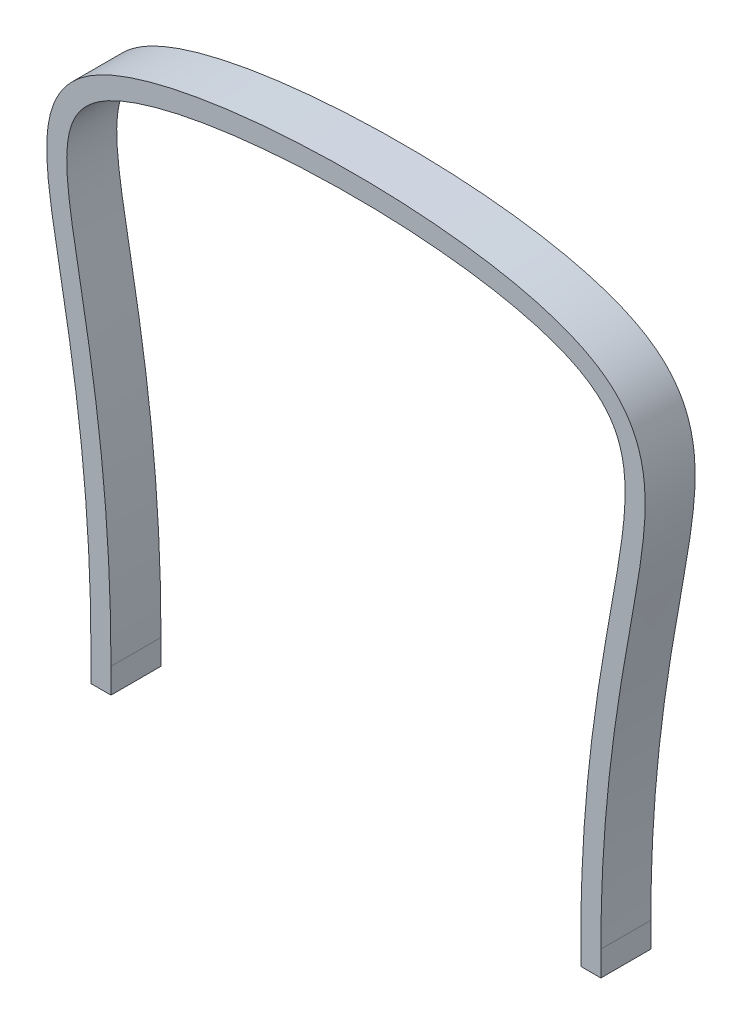
ISO-10303-21;
HEADER;
FILE_DESCRIPTION(('STEP AP214'),'2;1');
FILE_NAME('part.step','',(''),(''),'','','');
FILE_SCHEMA(('AUTOMOTIVE_DESIGN { 1 0 10303 214 1 1 1 1 }'));
ENDSEC;
DATA;
#1=APPLICATION_CONTEXT('core data for automotive mechanical design processes');
#2=APPLICATION_PROTOCOL_DEFINITION('international standard','automotive_design',2000,#1);
#3=PRODUCT_CONTEXT('',#1,'mechanical');
#4=PRODUCT('Part','Part','',(#3));
#5=PRODUCT_RELATED_PRODUCT_CATEGORY('part','',(#4));
#6=PRODUCT_DEFINITION_FORMATION('','',#4);
#7=PRODUCT_DEFINITION_CONTEXT('part definition',#1,'design');
#8=PRODUCT_DEFINITION('design','',#6,#7);
#9=PRODUCT_DEFINITION_SHAPE('','',#8);
#10=(LENGTH_UNIT() NAMED_UNIT(*) SI_UNIT(.MILLI.,.METRE.));
#11=(NAMED_UNIT(*) PLANE_ANGLE_UNIT() SI_UNIT($,.RADIAN.));
#12=(NAMED_UNIT(*) SI_UNIT($,.STERADIAN.) SOLID_ANGLE_UNIT());
#13=UNCERTAINTY_MEASURE_WITH_UNIT(LENGTH_MEASURE(1.E-05),#10,'distance_accuracy_value','');
#14=(GEOMETRIC_REPRESENTATION_CONTEXT(3) GLOBAL_UNCERTAINTY_ASSIGNED_CONTEXT((#13)) GLOBAL_UNIT_ASSIGNED_CONTEXT((#10,
#11,#12)) REPRESENTATION_CONTEXT('',''));
#15=CARTESIAN_POINT('',(0.,0.,0.));
#16=DIRECTION('',(0.,0.,1.));
#17=DIRECTION('',(1.,0.,0.));
#18=AXIS2_PLACEMENT_3D('',#15,#16,#17);
#19=CARTESIAN_POINT('',(-51.,0.,5.));
#20=DIRECTION('',(0.,0.,1.));
#21=DIRECTION('',(1.,0.,0.));
#22=AXIS2_PLACEMENT_3D('',#19,#20,#21);
#23=PLANE('',#22);
#24=CARTESIAN_POINT('',(-51.,0.,5.));
#25=CARTESIAN_POINT('',(-50.9939158983148,14.0079411844844,5.));
#26=CARTESIAN_POINT('',(-52.6916647073924,37.8272965966043,5.));
#27=CARTESIAN_POINT('',(-56.4295822448929,59.1981943965522,5.));
#28=CARTESIAN_POINT('',(-58.8718908608169,72.4728642051469,5.));
#29=CARTESIAN_POINT('',(-59.9906411581549,80.9564008757759,5.));
#30=CARTESIAN_POINT('',(-59.8482362618242,87.2736222326708,5.));
#31=CARTESIAN_POINT('',(-58.4666978349904,92.1639115550484,5.));
#32=CARTESIAN_POINT('',(-56.4370599692739,95.7228120031364,5.));
#33=CARTESIAN_POINT('',(-53.5144229960345,98.724680975445,5.));
#34=CARTESIAN_POINT('',(-50.7947948900949,100.525327543125,5.));
#35=CARTESIAN_POINT('',(-48.0497094835202,101.975149445809,5.));
#36=CARTESIAN_POINT('',(-45.0542295014906,103.295407098608,5.));
#37=CARTESIAN_POINT('',(-36.9311951979304,106.001290542632,5.));
#38=CARTESIAN_POINT('',(-22.1031727229768,108.736204229261,5.));
#39=CARTESIAN_POINT('',(-0.0315882016813909,110.056337559532,5.));
#40=CARTESIAN_POINT('',(22.0599381139701,109.047906079575,5.));
#41=CARTESIAN_POINT('',(36.9506499659262,106.334441293828,5.));
#42=CARTESIAN_POINT('',(45.1541967761085,103.414588011981,5.));
#43=CARTESIAN_POINT('',(48.1928062961276,101.9455729061,5.));
#44=CARTESIAN_POINT('',(50.9721994924086,100.312683081899,5.));
#45=CARTESIAN_POINT('',(53.7125423698637,98.2647928715529,5.));
#46=CARTESIAN_POINT('',(56.5797280575046,94.9085285501916,5.));
#47=CARTESIAN_POINT('',(58.5191733912946,91.0508570608467,5.));
#48=CARTESIAN_POINT('',(60.010062785228,85.148050903776,5.));
#49=CARTESIAN_POINT('',(59.9033006716471,76.8200327339042,5.));
#50=CARTESIAN_POINT('',(57.9715243729975,64.6609238006301,5.));
#51=CARTESIAN_POINT('',(55.0408595619276,48.8716214985142,5.));
#52=CARTESIAN_POINT('',(52.0427169733924,28.1799052357803,5.));
#53=CARTESIAN_POINT('',(50.9957016467325,10.0765282928764,5.));
#54=CARTESIAN_POINT('',(51.,0.,5.));
#55=B_SPLINE_CURVE_WITH_KNOTS('',3,(#24,#25,#26,#27,#28,#29,#30,#31,#32,#33,#34,#35,#36,#37,#38,
#39,#40,#41,#42,#43,#44,#45,#46,#47,#48,#49,#50,#51,#52,#53,#54),.UNSPECIFIED.,.F.,.F.,(4,1,1,1,
1,1,1,1,1,1,1,1,1,1,1,1,1,1,1,1,1,1,1,1,1,1,1,1,4),(0.,0.07,0.14,0.176666666666666,
0.213333333333333,0.249999999999999,0.270833333333333,0.291666666666698,0.3125,
0.333333333333333,0.337931034482759,0.354166666666667,0.375,0.4375,0.5,0.5625,0.625,
0.645833333333333,0.662068965517241,0.666666666666667,0.6875,0.708333333333333,
0.729166666666706,0.750000000000008,0.796666666666667,0.843333333333333,0.89,0.945,1.),.UNSPECIFIED.);
#56=CARTESIAN_POINT('',(-51.,0.,5.));
#57=VERTEX_POINT('',#56);
#58=CARTESIAN_POINT('',(51.,0.,5.));
#59=VERTEX_POINT('',#58);
#60=EDGE_CURVE('E73',#57,#59,#55,.T.);
#61=ORIENTED_EDGE('',*,*,#60,.F.);
#62=DIRECTION('',(0.,1.,0.));
#63=VECTOR('',#62,1.);
#64=CARTESIAN_POINT('',(-51.,-5.,5.));
#65=LINE('',#64,#63);
#66=CARTESIAN_POINT('',(-51.,-5.,5.));
#67=VERTEX_POINT('',#66);
#68=EDGE_CURVE('E155',#67,#57,#65,.T.);
#69=ORIENTED_EDGE('',*,*,#68,.F.);
#70=DIRECTION('',(-1.,0.,0.));
#71=VECTOR('',#70,1.);
#72=CARTESIAN_POINT('',(-47.,-5.,5.));
#73=LINE('',#72,#71);
#74=CARTESIAN_POINT('',(-47.,-5.,5.));
#75=VERTEX_POINT('',#74);
#76=EDGE_CURVE('E148',#75,#67,#73,.T.);
#77=ORIENTED_EDGE('',*,*,#76,.F.);
#78=DIRECTION('',(0.,1.,0.));
#79=VECTOR('',#78,1.);
#80=CARTESIAN_POINT('',(-47.,-5.,5.));
#81=LINE('',#80,#79);
#82=CARTESIAN_POINT('',(-47.,0.,5.));
#83=VERTEX_POINT('',#82);
#84=EDGE_CURVE('E157',#75,#83,#81,.T.);
#85=ORIENTED_EDGE('',*,*,#84,.T.);
#86=CARTESIAN_POINT('',(-47.,0.,5.));
#87=CARTESIAN_POINT('',(-47.,14.1678904448825,5.));
#88=CARTESIAN_POINT('',(-48.7099170124481,38.3071443777987,5.));
#89=CARTESIAN_POINT('',(-52.5013962655601,59.9500836802956,5.));
#90=CARTESIAN_POINT('',(-54.9296501350194,73.1541154957616,5.));
#91=CARTESIAN_POINT('',(-55.9932265880073,81.2923477800299,5.));
#92=CARTESIAN_POINT('',(-55.8266879192895,86.8105046067798,5.));
#93=CARTESIAN_POINT('',(-54.7298430502037,90.625037430008,5.));
#94=CARTESIAN_POINT('',(-53.2166005076598,93.2755599127199,5.));
#95=CARTESIAN_POINT('',(-50.9812207732317,95.5886454763646,5.));
#96=CARTESIAN_POINT('',(-48.7297717842323,97.0922000296025,5.));
#97=CARTESIAN_POINT('',(-46.3398455509451,98.3542379754933,5.));
#98=CARTESIAN_POINT('',(-43.6470003457814,99.544917332511,5.));
#99=CARTESIAN_POINT('',(-36.0530637755289,102.081231212679,5.));
#100=CARTESIAN_POINT('',(-21.6597510373443,104.755013770526,5.));
#101=CARTESIAN_POINT('',(0.,106.048480692159,5.));
#102=CARTESIAN_POINT('',(21.6597510373444,105.061123179686,5.));
#103=CARTESIAN_POINT('',(36.053063775529,102.412982057951,5.));
#104=CARTESIAN_POINT('',(43.6470003457815,99.7007781023926,5.));
#105=CARTESIAN_POINT('',(46.3398455509452,98.3944935961712,5.));
#106=CARTESIAN_POINT('',(48.7297717842324,96.9906177207409,5.));
#107=CARTESIAN_POINT('',(50.9812207732332,95.2959338525326,5.));
#108=CARTESIAN_POINT('',(53.2166005076622,92.6693953758901,5.));
#109=CARTESIAN_POINT('',(54.7298430502051,89.6693785873729,5.));
#110=CARTESIAN_POINT('',(55.9667106685344,84.8501422152859,5.));
#111=CARTESIAN_POINT('',(55.9257189314176,77.3012232779133,5.));
#112=CARTESIAN_POINT('',(54.039908123277,65.3970285872392,5.));
#113=CARTESIAN_POINT('',(51.0977919065966,49.546781732453,5.));
#114=CARTESIAN_POINT('',(48.055612033195,28.583522396918,5.));
#115=CARTESIAN_POINT('',(47.,10.211067346589,5.));
#116=CARTESIAN_POINT('',(47.,0.,5.));
#117=B_SPLINE_CURVE_WITH_KNOTS('',3,(#86,#87,#88,#89,#90,#91,#92,#93,#94,#95,#96,#97,#98,#99,
#100,#101,#102,#103,#104,#105,#106,#107,#108,#109,#110,#111,#112,#113,#114,#115,#116),
.UNSPECIFIED.,.F.,.F.,(4,1,1,1,1,1,1,1,1,1,1,1,1,1,1,1,1,1,1,1,1,1,1,1,1,1,1,1,4),(0.,0.07,0.14,
0.176666666666666,0.213333333333333,0.249999999999999,0.270833333333333,0.291666666666698,
0.3125,0.333333333333333,0.337931034482759,0.354166666666667,0.375,0.4375,0.5,0.5625,0.625,
0.645833333333333,0.662068965517241,0.666666666666667,0.6875,0.708333333333333,
0.729166666666706,0.750000000000008,0.796666666666667,0.843333333333333,0.89,0.945,1.),.UNSPECIFIED.);
#118=CARTESIAN_POINT('',(47.,0.,5.));
#119=VERTEX_POINT('',#118);
#120=EDGE_CURVE('E137',#83,#119,#117,.T.);
#121=ORIENTED_EDGE('',*,*,#120,.T.);
#122=DIRECTION('',(0.,1.,0.));
#123=VECTOR('',#122,1.);
#124=CARTESIAN_POINT('',(47.,-5.,5.));
#125=LINE('',#124,#123);
#126=CARTESIAN_POINT('',(47.,-5.,5.));
#127=VERTEX_POINT('',#126);
#128=EDGE_CURVE('E120',#127,#119,#125,.T.);
#129=ORIENTED_EDGE('',*,*,#128,.F.);
#130=DIRECTION('',(-1.,0.,0.));
#131=VECTOR('',#130,1.);
#132=CARTESIAN_POINT('',(51.,-5.,5.));
#133=LINE('',#132,#131);
#134=CARTESIAN_POINT('',(51.,-5.,5.));
#135=VERTEX_POINT('',#134);
#136=EDGE_CURVE('E126',#135,#127,#133,.T.);
#137=ORIENTED_EDGE('',*,*,#136,.F.);
#138=DIRECTION('',(0.,1.,0.));
#139=VECTOR('',#138,1.);
#140=CARTESIAN_POINT('',(51.,-5.,5.));
#141=LINE('',#140,#139);
#142=EDGE_CURVE('E198',#135,#59,#141,.T.);
#143=ORIENTED_EDGE('',*,*,#142,.T.);
#144=EDGE_LOOP('',(#61,#69,#77,#85,#121,#129,#137,#143));
#145=FACE_BOUND('',#144,.T.);
#146=ADVANCED_FACE('F51',(#145),#23,.T.);
#147=CARTESIAN_POINT('',(-51.,0.,-5.));
#148=CARTESIAN_POINT('',(-50.9939158983148,14.0079411844844,-5.));
#149=CARTESIAN_POINT('',(-52.6916647073924,37.8272965966043,-5.));
#150=CARTESIAN_POINT('',(-56.4295822448929,59.1981943965522,-5.));
#151=CARTESIAN_POINT('',(-58.8718908608169,72.4728642051469,-5.));
#152=CARTESIAN_POINT('',(-59.9906411581549,80.9564008757759,-5.));
#153=CARTESIAN_POINT('',(-59.8482362618242,87.2736222326708,-5.));
#154=CARTESIAN_POINT('',(-58.4666978349904,92.1639115550484,-5.));
#155=CARTESIAN_POINT('',(-56.4370599692739,95.7228120031364,-5.));
#156=CARTESIAN_POINT('',(-53.5144229960345,98.724680975445,-5.));
#157=CARTESIAN_POINT('',(-50.7947948900949,100.525327543125,-5.));
#158=CARTESIAN_POINT('',(-48.0497094835202,101.975149445809,-5.));
#159=CARTESIAN_POINT('',(-45.0542295014906,103.295407098608,-5.));
#160=CARTESIAN_POINT('',(-36.9311951979304,106.001290542632,-5.));
#161=CARTESIAN_POINT('',(-22.1031727229768,108.736204229261,-5.));
#162=CARTESIAN_POINT('',(-0.0315882016813909,110.056337559532,-5.));
#163=CARTESIAN_POINT('',(22.0599381139701,109.047906079575,-5.));
#164=CARTESIAN_POINT('',(36.9506499659262,106.334441293828,-5.));
#165=CARTESIAN_POINT('',(45.1541967761085,103.414588011981,-5.));
#166=CARTESIAN_POINT('',(48.1928062961276,101.9455729061,-5.));
#167=CARTESIAN_POINT('',(50.9721994924086,100.312683081899,-5.));
#168=CARTESIAN_POINT('',(53.7125423698638,98.2647928715529,-5.));
#169=CARTESIAN_POINT('',(56.5797280575046,94.9085285501916,-5.));
#170=CARTESIAN_POINT('',(58.5191733912946,91.0508570608467,-5.));
#171=CARTESIAN_POINT('',(60.010062785228,85.1480509037761,-5.));
#172=CARTESIAN_POINT('',(59.9033006716471,76.8200327339042,-5.));
#173=CARTESIAN_POINT('',(57.9715243729975,64.6609238006302,-5.));
#174=CARTESIAN_POINT('',(55.0408595619276,48.8716214985142,-5.));
#175=CARTESIAN_POINT('',(52.0427169733924,28.1799052357803,-5.));
#176=CARTESIAN_POINT('',(50.9957016467325,10.0765282928764,-5.));
#177=CARTESIAN_POINT('',(51.,0.,-5.));
#178=CARTESIAN_POINT('',(-51.,0.,5.));
#179=CARTESIAN_POINT('',(-50.9939158983148,14.0079411844844,5.));
#180=CARTESIAN_POINT('',(-52.6916647073924,37.8272965966043,5.));
#181=CARTESIAN_POINT('',(-56.4295822448929,59.1981943965522,5.));
#182=CARTESIAN_POINT('',(-58.8718908608169,72.4728642051469,5.));
#183=CARTESIAN_POINT('',(-59.9906411581549,80.9564008757759,5.));
#184=CARTESIAN_POINT('',(-59.8482362618242,87.2736222326708,5.));
#185=CARTESIAN_POINT('',(-58.4666978349904,92.1639115550484,5.));
#186=CARTESIAN_POINT('',(-56.4370599692739,95.7228120031364,5.));
#187=CARTESIAN_POINT('',(-53.5144229960345,98.724680975445,5.));
#188=CARTESIAN_POINT('',(-50.7947948900949,100.525327543125,5.));
#189=CARTESIAN_POINT('',(-48.0497094835202,101.975149445809,5.));
#190=CARTESIAN_POINT('',(-45.0542295014906,103.295407098608,5.));
#191=CARTESIAN_POINT('',(-36.9311951979304,106.001290542632,5.));
#192=CARTESIAN_POINT('',(-22.1031727229768,108.736204229261,5.));
#193=CARTESIAN_POINT('',(-0.0315882016813909,110.056337559532,5.));
#194=CARTESIAN_POINT('',(22.0599381139701,109.047906079575,5.));
#195=CARTESIAN_POINT('',(36.9506499659262,106.334441293828,5.));
#196=CARTESIAN_POINT('',(45.1541967761085,103.414588011981,5.));
#197=CARTESIAN_POINT('',(48.1928062961276,101.9455729061,5.));
#198=CARTESIAN_POINT('',(50.9721994924086,100.312683081899,5.));
#199=CARTESIAN_POINT('',(53.7125423698637,98.2647928715529,5.));
#200=CARTESIAN_POINT('',(56.5797280575046,94.9085285501916,5.));
#201=CARTESIAN_POINT('',(58.5191733912946,91.0508570608467,5.));
#202=CARTESIAN_POINT('',(60.010062785228,85.148050903776,5.));
#203=CARTESIAN_POINT('',(59.9033006716471,76.8200327339042,5.));
#204=CARTESIAN_POINT('',(57.9715243729975,64.6609238006301,5.));
#205=CARTESIAN_POINT('',(55.0408595619276,48.8716214985142,5.));
#206=CARTESIAN_POINT('',(52.0427169733924,28.1799052357803,5.));
#207=CARTESIAN_POINT('',(50.9957016467325,10.0765282928764,5.));
#208=CARTESIAN_POINT('',(51.,0.,5.));
#209=B_SPLINE_SURFACE_WITH_KNOTS('',1,3,((#147,#148,#149,#150,#151,#152,#153,#154,#155,#156,
#157,#158,#159,#160,#161,#162,#163,#164,#165,#166,#167,#168,#169,#170,#171,#172,#173,#174,#175,
#176,#177),(#178,#179,#180,#181,#182,#183,#184,#185,#186,#187,#188,#189,#190,#191,#192,#193,
#194,#195,#196,#197,#198,#199,#200,#201,#202,#203,#204,#205,#206,#207,#208)),.UNSPECIFIED.,.F.,
.F.,.F.,(2,2),(4,1,1,1,1,1,1,1,1,1,1,1,1,1,1,1,1,1,1,1,1,1,1,1,1,1,1,1,4),(0.5,
0.857142857142857),(0.,0.07,0.14,0.176666666666666,0.213333333333333,0.249999999999999,
0.270833333333333,0.291666666666698,0.3125,0.333333333333333,0.337931034482759,
0.354166666666667,0.375,0.4375,0.5,0.5625,0.625,0.645833333333333,0.662068965517241,
0.666666666666667,0.6875,0.708333333333333,0.729166666666706,0.750000000000008,
0.796666666666667,0.843333333333333,0.89,0.945,1.),.UNSPECIFIED.);
#210=DIRECTION('',(0.,0.,1.));
#211=VECTOR('',#210,1.);
#212=CARTESIAN_POINT('',(-51.,0.,-5.));
#213=LINE('',#212,#211);
#214=CARTESIAN_POINT('',(-51.,0.,-5.));
#215=VERTEX_POINT('',#214);
#216=EDGE_CURVE('E164',#215,#57,#213,.T.);
#217=DIRECTION('',(0.,0.,1.));
#218=VECTOR('',#217,1.);
#219=CARTESIAN_POINT('',(51.,0.,-5.));
#220=LINE('',#219,#218);
#221=CARTESIAN_POINT('',(51.,0.,-5.));
#222=VERTEX_POINT('',#221);
#223=EDGE_CURVE('E12',#222,#59,#220,.T.);
#224=CARTESIAN_POINT('',(-51.,0.,-5.));
#225=CARTESIAN_POINT('',(-50.9939158983148,14.0079411844844,-5.));
#226=CARTESIAN_POINT('',(-52.6916647073924,37.8272965966043,-5.));
#227=CARTESIAN_POINT('',(-56.4295822448929,59.1981943965522,-5.));
#228=CARTESIAN_POINT('',(-58.8718908608169,72.4728642051469,-5.));
#229=CARTESIAN_POINT('',(-59.9906411581549,80.9564008757759,-5.));
#230=CARTESIAN_POINT('',(-59.8482362618242,87.2736222326708,-5.));
#231=CARTESIAN_POINT('',(-58.4666978349904,92.1639115550484,-5.));
#232=CARTESIAN_POINT('',(-56.4370599692739,95.7228120031364,-5.));
#233=CARTESIAN_POINT('',(-53.5144229960345,98.724680975445,-5.));
#234=CARTESIAN_POINT('',(-50.7947948900949,100.525327543125,-5.));
#235=CARTESIAN_POINT('',(-48.0497094835202,101.975149445809,-5.));
#236=CARTESIAN_POINT('',(-45.0542295014906,103.295407098608,-5.));
#237=CARTESIAN_POINT('',(-36.9311951979304,106.001290542632,-5.));
#238=CARTESIAN_POINT('',(-22.1031727229768,108.736204229261,-5.));
#239=CARTESIAN_POINT('',(-0.0315882016813909,110.056337559532,-5.));
#240=CARTESIAN_POINT('',(22.0599381139701,109.047906079575,-5.));
#241=CARTESIAN_POINT('',(36.9506499659262,106.334441293828,-5.));
#242=CARTESIAN_POINT('',(45.1541967761085,103.414588011981,-5.));
#243=CARTESIAN_POINT('',(48.1928062961276,101.9455729061,-5.));
#244=CARTESIAN_POINT('',(50.9721994924086,100.312683081899,-5.));
#245=CARTESIAN_POINT('',(53.7125423698638,98.2647928715529,-5.));
#246=CARTESIAN_POINT('',(56.5797280575046,94.9085285501916,-5.));
#247=CARTESIAN_POINT('',(58.5191733912946,91.0508570608467,-5.));
#248=CARTESIAN_POINT('',(60.010062785228,85.1480509037761,-5.));
#249=CARTESIAN_POINT('',(59.9033006716471,76.8200327339042,-5.));
#250=CARTESIAN_POINT('',(57.9715243729975,64.6609238006302,-5.));
#251=CARTESIAN_POINT('',(55.0408595619276,48.8716214985142,-5.));
#252=CARTESIAN_POINT('',(52.0427169733924,28.1799052357803,-5.));
#253=CARTESIAN_POINT('',(50.9957016467325,10.0765282928764,-5.));
#254=CARTESIAN_POINT('',(51.,0.,-5.));
#255=B_SPLINE_CURVE_WITH_KNOTS('',3,(#224,#225,#226,#227,#228,#229,#230,#231,#232,#233,#234,
#235,#236,#237,#238,#239,#240,#241,#242,#243,#244,#245,#246,#247,#248,#249,#250,#251,#252,#253,
#254),.UNSPECIFIED.,.F.,.F.,(4,1,1,1,1,1,1,1,1,1,1,1,1,1,1,1,1,1,1,1,1,1,1,1,1,1,1,1,4),(0.,
0.07,0.14,0.176666666666666,0.213333333333333,0.249999999999999,0.270833333333333,
0.291666666666698,0.3125,0.333333333333333,0.337931034482759,0.354166666666667,0.375,0.4375,0.5,
0.5625,0.625,0.645833333333333,0.662068965517241,0.666666666666667,0.6875,0.708333333333333,
0.729166666666706,0.750000000000008,0.796666666666667,0.843333333333333,0.89,0.945,1.),.UNSPECIFIED.);
#256=EDGE_CURVE('E176',#215,#222,#255,.T.);
#257=ORIENTED_EDGE('',*,*,#216,.T.);
#258=ORIENTED_EDGE('',*,*,#60,.T.);
#259=ORIENTED_EDGE('',*,*,#223,.F.);
#260=ORIENTED_EDGE('',*,*,#256,.F.);
#261=EDGE_LOOP('',(#257,#258,#259,#260));
#262=FACE_BOUND('',#261,.T.);
#263=ADVANCED_FACE('F223',(#262),#209,.T.);
#264=CARTESIAN_POINT('',(-47.,0.,-5.));
#265=DIRECTION('',(0.,0.,-1.));
#266=DIRECTION('',(-1.,0.,0.));
#267=AXIS2_PLACEMENT_3D('',#264,#265,#266);
#268=PLANE('',#267);
#269=CARTESIAN_POINT('',(-47.,0.,-5.));
#270=CARTESIAN_POINT('',(-47.,14.1678904448825,-5.));
#271=CARTESIAN_POINT('',(-48.7099170124481,38.3071443777987,-5.));
#272=CARTESIAN_POINT('',(-52.5013962655601,59.9500836802956,-5.));
#273=CARTESIAN_POINT('',(-54.9296501350194,73.1541154957616,-5.));
#274=CARTESIAN_POINT('',(-55.9932265880073,81.2923477800299,-5.));
#275=CARTESIAN_POINT('',(-55.8266879192895,86.8105046067798,-5.));
#276=CARTESIAN_POINT('',(-54.7298430502037,90.625037430008,-5.));
#277=CARTESIAN_POINT('',(-53.2166005076598,93.2755599127199,-5.));
#278=CARTESIAN_POINT('',(-50.9812207732317,95.5886454763646,-5.));
#279=CARTESIAN_POINT('',(-48.7297717842323,97.0922000296025,-5.));
#280=CARTESIAN_POINT('',(-46.3398455509451,98.3542379754933,-5.));
#281=CARTESIAN_POINT('',(-43.6470003457814,99.544917332511,-5.));
#282=CARTESIAN_POINT('',(-36.0530637755289,102.081231212679,-5.));
#283=CARTESIAN_POINT('',(-21.6597510373443,104.755013770526,-5.));
#284=CARTESIAN_POINT('',(0.,106.048480692159,-5.));
#285=CARTESIAN_POINT('',(21.6597510373444,105.061123179686,-5.));
#286=CARTESIAN_POINT('',(36.053063775529,102.412982057951,-5.));
#287=CARTESIAN_POINT('',(43.6470003457815,99.7007781023926,-5.));
#288=CARTESIAN_POINT('',(46.3398455509452,98.3944935961712,-5.));
#289=CARTESIAN_POINT('',(48.7297717842324,96.9906177207409,-5.));
#290=CARTESIAN_POINT('',(50.9812207732332,95.2959338525326,-5.));
#291=CARTESIAN_POINT('',(53.2166005076622,92.6693953758901,-5.));
#292=CARTESIAN_POINT('',(54.7298430502051,89.6693785873729,-5.));
#293=CARTESIAN_POINT('',(55.9667106685344,84.8501422152859,-5.));
#294=CARTESIAN_POINT('',(55.9257189314176,77.3012232779133,-5.));
#295=CARTESIAN_POINT('',(54.039908123277,65.3970285872392,-5.));
#296=CARTESIAN_POINT('',(51.0977919065966,49.546781732453,-5.));
#297=CARTESIAN_POINT('',(48.055612033195,28.583522396918,-5.));
#298=CARTESIAN_POINT('',(47.,10.211067346589,-5.));
#299=CARTESIAN_POINT('',(47.,0.,-5.));
#300=B_SPLINE_CURVE_WITH_KNOTS('',3,(#269,#270,#271,#272,#273,#274,#275,#276,#277,#278,#279,
#280,#281,#282,#283,#284,#285,#286,#287,#288,#289,#290,#291,#292,#293,#294,#295,#296,#297,#298,
#299),.UNSPECIFIED.,.F.,.F.,(4,1,1,1,1,1,1,1,1,1,1,1,1,1,1,1,1,1,1,1,1,1,1,1,1,1,1,1,4),(0.,
0.07,0.14,0.176666666666666,0.213333333333333,0.249999999999999,0.270833333333333,
0.291666666666698,0.3125,0.333333333333333,0.337931034482759,0.354166666666667,0.375,0.4375,0.5,
0.5625,0.625,0.645833333333333,0.662068965517241,0.666666666666667,0.6875,0.708333333333333,
0.729166666666706,0.750000000000008,0.796666666666667,0.843333333333333,0.89,0.945,1.),.UNSPECIFIED.);
#301=CARTESIAN_POINT('',(-47.,0.,-5.));
#302=VERTEX_POINT('',#301);
#303=CARTESIAN_POINT('',(47.,0.,-5.));
#304=VERTEX_POINT('',#303);
#305=EDGE_CURVE('E166',#302,#304,#300,.T.);
#306=ORIENTED_EDGE('',*,*,#305,.F.);
#307=DIRECTION('',(0.,1.,0.));
#308=VECTOR('',#307,1.);
#309=CARTESIAN_POINT('',(-47.,-5.,-5.));
#310=LINE('',#309,#308);
#311=CARTESIAN_POINT('',(-47.,-5.,-5.));
#312=VERTEX_POINT('',#311);
#313=EDGE_CURVE('E159',#312,#302,#310,.T.);
#314=ORIENTED_EDGE('',*,*,#313,.F.);
#315=DIRECTION('',(1.,0.,0.));
#316=VECTOR('',#315,1.);
#317=CARTESIAN_POINT('',(-51.,-5.,-5.));
#318=LINE('',#317,#316);
#319=CARTESIAN_POINT('',(-51.,-5.,-5.));
#320=VERTEX_POINT('',#319);
#321=EDGE_CURVE('E138',#320,#312,#318,.T.);
#322=ORIENTED_EDGE('',*,*,#321,.F.);
#323=DIRECTION('',(0.,1.,0.));
#324=VECTOR('',#323,1.);
#325=CARTESIAN_POINT('',(-51.,-5.,-5.));
#326=LINE('',#325,#324);
#327=EDGE_CURVE('E152',#320,#215,#326,.T.);
#328=ORIENTED_EDGE('',*,*,#327,.T.);
#329=ORIENTED_EDGE('',*,*,#256,.T.);
#330=DIRECTION('',(0.,1.,0.));
#331=VECTOR('',#330,1.);
#332=CARTESIAN_POINT('',(51.,-5.,-5.));
#333=LINE('',#332,#331);
#334=CARTESIAN_POINT('',(51.,-5.,-5.));
#335=VERTEX_POINT('',#334);
#336=EDGE_CURVE('E143',#335,#222,#333,.T.);
#337=ORIENTED_EDGE('',*,*,#336,.F.);
#338=DIRECTION('',(1.,0.,0.));
#339=VECTOR('',#338,1.);
#340=CARTESIAN_POINT('',(47.,-5.,-5.));
#341=LINE('',#340,#339);
#342=CARTESIAN_POINT('',(47.,-5.,-5.));
#343=VERTEX_POINT('',#342);
#344=EDGE_CURVE('E125',#343,#335,#341,.T.);
#345=ORIENTED_EDGE('',*,*,#344,.F.);
#346=DIRECTION('',(0.,1.,0.));
#347=VECTOR('',#346,1.);
#348=CARTESIAN_POINT('',(47.,-5.,-5.));
#349=LINE('',#348,#347);
#350=EDGE_CURVE('E122',#343,#304,#349,.T.);
#351=ORIENTED_EDGE('',*,*,#350,.T.);
#352=EDGE_LOOP('',(#306,#314,#322,#328,#329,#337,#345,#351));
#353=FACE_BOUND('',#352,.T.);
#354=ADVANCED_FACE('F53',(#353),#268,.T.);
#355=CARTESIAN_POINT('',(-47.,0.,5.));
#356=CARTESIAN_POINT('',(-47.,14.1678904448825,5.));
#357=CARTESIAN_POINT('',(-48.7099170124481,38.3071443777987,5.));
#358=CARTESIAN_POINT('',(-52.5013962655601,59.9500836802956,5.));
#359=CARTESIAN_POINT('',(-54.9296501350194,73.1541154957616,5.));
#360=CARTESIAN_POINT('',(-55.9932265880073,81.2923477800299,5.));
#361=CARTESIAN_POINT('',(-55.8266879192895,86.8105046067798,5.));
#362=CARTESIAN_POINT('',(-54.7298430502037,90.625037430008,5.));
#363=CARTESIAN_POINT('',(-53.2166005076598,93.2755599127199,5.));
#364=CARTESIAN_POINT('',(-50.9812207732317,95.5886454763646,5.));
#365=CARTESIAN_POINT('',(-48.7297717842323,97.0922000296025,5.));
#366=CARTESIAN_POINT('',(-46.3398455509451,98.3542379754933,5.));
#367=CARTESIAN_POINT('',(-43.6470003457814,99.544917332511,5.));
#368=CARTESIAN_POINT('',(-36.0530637755289,102.081231212679,5.));
#369=CARTESIAN_POINT('',(-21.6597510373443,104.755013770526,5.));
#370=CARTESIAN_POINT('',(0.,106.048480692159,5.));
#371=CARTESIAN_POINT('',(21.6597510373444,105.061123179686,5.));
#372=CARTESIAN_POINT('',(36.053063775529,102.412982057951,5.));
#373=CARTESIAN_POINT('',(43.6470003457815,99.7007781023926,5.));
#374=CARTESIAN_POINT('',(46.3398455509452,98.3944935961712,5.));
#375=CARTESIAN_POINT('',(48.7297717842324,96.9906177207409,5.));
#376=CARTESIAN_POINT('',(50.9812207732332,95.2959338525326,5.));
#377=CARTESIAN_POINT('',(53.2166005076622,92.6693953758901,5.));
#378=CARTESIAN_POINT('',(54.7298430502051,89.6693785873729,5.));
#379=CARTESIAN_POINT('',(55.9667106685344,84.8501422152859,5.));
#380=CARTESIAN_POINT('',(55.9257189314176,77.3012232779133,5.));
#381=CARTESIAN_POINT('',(54.039908123277,65.3970285872392,5.));
#382=CARTESIAN_POINT('',(51.0977919065966,49.546781732453,5.));
#383=CARTESIAN_POINT('',(48.055612033195,28.583522396918,5.));
#384=CARTESIAN_POINT('',(47.,10.211067346589,5.));
#385=CARTESIAN_POINT('',(47.,0.,5.));
#386=CARTESIAN_POINT('',(-47.,0.,-5.));
#387=CARTESIAN_POINT('',(-47.,14.1678904448825,-5.));
#388=CARTESIAN_POINT('',(-48.7099170124481,38.3071443777987,-5.));
#389=CARTESIAN_POINT('',(-52.5013962655601,59.9500836802956,-5.));
#390=CARTESIAN_POINT('',(-54.9296501350194,73.1541154957616,-5.));
#391=CARTESIAN_POINT('',(-55.9932265880073,81.2923477800299,-5.));
#392=CARTESIAN_POINT('',(-55.8266879192895,86.8105046067798,-5.));
#393=CARTESIAN_POINT('',(-54.7298430502037,90.625037430008,-5.));
#394=CARTESIAN_POINT('',(-53.2166005076598,93.2755599127199,-5.));
#395=CARTESIAN_POINT('',(-50.9812207732317,95.5886454763646,-5.));
#396=CARTESIAN_POINT('',(-48.7297717842323,97.0922000296025,-5.));
#397=CARTESIAN_POINT('',(-46.3398455509451,98.3542379754933,-5.));
#398=CARTESIAN_POINT('',(-43.6470003457814,99.544917332511,-5.));
#399=CARTESIAN_POINT('',(-36.0530637755289,102.081231212679,-5.));
#400=CARTESIAN_POINT('',(-21.6597510373443,104.755013770526,-5.));
#401=CARTESIAN_POINT('',(0.,106.048480692159,-5.));
#402=CARTESIAN_POINT('',(21.6597510373444,105.061123179686,-5.));
#403=CARTESIAN_POINT('',(36.053063775529,102.412982057951,-5.));
#404=CARTESIAN_POINT('',(43.6470003457815,99.7007781023926,-5.));
#405=CARTESIAN_POINT('',(46.3398455509452,98.3944935961712,-5.));
#406=CARTESIAN_POINT('',(48.7297717842324,96.9906177207409,-5.));
#407=CARTESIAN_POINT('',(50.9812207732332,95.2959338525326,-5.));
#408=CARTESIAN_POINT('',(53.2166005076622,92.6693953758901,-5.));
#409=CARTESIAN_POINT('',(54.7298430502051,89.6693785873729,-5.));
#410=CARTESIAN_POINT('',(55.9667106685344,84.8501422152859,-5.));
#411=CARTESIAN_POINT('',(55.9257189314176,77.3012232779133,-5.));
#412=CARTESIAN_POINT('',(54.039908123277,65.3970285872392,-5.));
#413=CARTESIAN_POINT('',(51.0977919065966,49.546781732453,-5.));
#414=CARTESIAN_POINT('',(48.055612033195,28.583522396918,-5.));
#415=CARTESIAN_POINT('',(47.,10.211067346589,-5.));
#416=CARTESIAN_POINT('',(47.,0.,-5.));
#417=B_SPLINE_SURFACE_WITH_KNOTS('',1,3,((#355,#356,#357,#358,#359,#360,#361,#362,#363,#364,
#365,#366,#367,#368,#369,#370,#371,#372,#373,#374,#375,#376,#377,#378,#379,#380,#381,#382,#383,
#384,#385),(#386,#387,#388,#389,#390,#391,#392,#393,#394,#395,#396,#397,#398,#399,#400,#401,
#402,#403,#404,#405,#406,#407,#408,#409,#410,#411,#412,#413,#414,#415,#416)),.UNSPECIFIED.,.F.,
.F.,.F.,(2,2),(4,1,1,1,1,1,1,1,1,1,1,1,1,1,1,1,1,1,1,1,1,1,1,1,1,1,1,1,4),(0.,
0.357142857142857),(0.,0.07,0.14,0.176666666666666,0.213333333333333,0.249999999999999,
0.270833333333333,0.291666666666698,0.3125,0.333333333333333,0.337931034482759,
0.354166666666667,0.375,0.4375,0.5,0.5625,0.625,0.645833333333333,0.662068965517241,
0.666666666666667,0.6875,0.708333333333333,0.729166666666706,0.750000000000008,
0.796666666666667,0.843333333333333,0.89,0.945,1.),.UNSPECIFIED.);
#418=DIRECTION('',(0.,0.,-1.));
#419=VECTOR('',#418,1.);
#420=CARTESIAN_POINT('',(-47.,0.,-5.));
#421=LINE('',#420,#419);
#422=EDGE_CURVE('E161',#83,#302,#421,.T.);
#423=DIRECTION('',(0.,0.,-1.));
#424=VECTOR('',#423,1.);
#425=CARTESIAN_POINT('',(47.,0.,-5.));
#426=LINE('',#425,#424);
#427=EDGE_CURVE('E59',#119,#304,#426,.T.);
#428=ORIENTED_EDGE('',*,*,#422,.T.);
#429=ORIENTED_EDGE('',*,*,#305,.T.);
#430=ORIENTED_EDGE('',*,*,#427,.F.);
#431=ORIENTED_EDGE('',*,*,#120,.F.);
#432=EDGE_LOOP('',(#428,#429,#430,#431));
#433=FACE_BOUND('',#432,.T.);
#434=ADVANCED_FACE('F215',(#433),#417,.T.);
#435=CARTESIAN_POINT('',(-47.,-5.,-5.));
#436=DIRECTION('',(-1.,0.,0.));
#437=DIRECTION('',(0.,0.,1.));
#438=AXIS2_PLACEMENT_3D('',#435,#436,#437);
#439=PLANE('',#438);
#440=ORIENTED_EDGE('',*,*,#422,.F.);
#441=ORIENTED_EDGE('',*,*,#84,.F.);
#442=DIRECTION('',(0.,0.,1.));
#443=VECTOR('',#442,1.);
#444=CARTESIAN_POINT('',(-47.,-5.,-5.));
#445=LINE('',#444,#443);
#446=EDGE_CURVE('E141',#312,#75,#445,.T.);
#447=ORIENTED_EDGE('',*,*,#446,.F.);
#448=ORIENTED_EDGE('',*,*,#313,.T.);
#449=EDGE_LOOP('',(#440,#441,#447,#448));
#450=FACE_BOUND('',#449,.T.);
#451=ADVANCED_FACE('F214',(#450),#439,.F.);
#452=CARTESIAN_POINT('',(-51.,-5.,5.));
#453=DIRECTION('',(1.,0.,0.));
#454=DIRECTION('',(0.,0.,-1.));
#455=AXIS2_PLACEMENT_3D('',#452,#453,#454);
#456=PLANE('',#455);
#457=ORIENTED_EDGE('',*,*,#216,.F.);
#458=ORIENTED_EDGE('',*,*,#327,.F.);
#459=DIRECTION('',(0.,0.,-1.));
#460=VECTOR('',#459,1.);
#461=CARTESIAN_POINT('',(-51.,-5.,5.));
#462=LINE('',#461,#460);
#463=EDGE_CURVE('E150',#67,#320,#462,.T.);
#464=ORIENTED_EDGE('',*,*,#463,.F.);
#465=ORIENTED_EDGE('',*,*,#68,.T.);
#466=EDGE_LOOP('',(#457,#458,#464,#465));
#467=FACE_BOUND('',#466,.T.);
#468=ADVANCED_FACE('F208',(#467),#456,.F.);
#469=CARTESIAN_POINT('',(0.,-5.,0.));
#470=DIRECTION('',(0.,-1.,0.));
#471=DIRECTION('',(0.,0.,-1.));
#472=AXIS2_PLACEMENT_3D('',#469,#470,#471);
#473=PLANE('',#472);
#474=ORIENTED_EDGE('',*,*,#321,.T.);
#475=ORIENTED_EDGE('',*,*,#446,.T.);
#476=ORIENTED_EDGE('',*,*,#76,.T.);
#477=ORIENTED_EDGE('',*,*,#463,.T.);
#478=EDGE_LOOP('',(#474,#475,#476,#477));
#479=FACE_BOUND('',#478,.T.);
#480=ADVANCED_FACE('F211',(#479),#473,.T.);
#481=CARTESIAN_POINT('',(47.,-5.,5.));
#482=DIRECTION('',(1.,0.,0.));
#483=DIRECTION('',(0.,0.,-1.));
#484=AXIS2_PLACEMENT_3D('',#481,#482,#483);
#485=PLANE('',#484);
#486=ORIENTED_EDGE('',*,*,#427,.T.);
#487=ORIENTED_EDGE('',*,*,#350,.F.);
#488=DIRECTION('',(0.,0.,-1.));
#489=VECTOR('',#488,1.);
#490=CARTESIAN_POINT('',(47.,-5.,5.));
#491=LINE('',#490,#489);
#492=EDGE_CURVE('E116',#127,#343,#491,.T.);
#493=ORIENTED_EDGE('',*,*,#492,.F.);
#494=ORIENTED_EDGE('',*,*,#128,.T.);
#495=EDGE_LOOP('',(#486,#487,#493,#494));
#496=FACE_BOUND('',#495,.T.);
#497=ADVANCED_FACE('F118',(#496),#485,.F.);
#498=CARTESIAN_POINT('',(51.,-5.,-5.));
#499=DIRECTION('',(-1.,0.,0.));
#500=DIRECTION('',(0.,0.,1.));
#501=AXIS2_PLACEMENT_3D('',#498,#499,#500);
#502=PLANE('',#501);
#503=ORIENTED_EDGE('',*,*,#223,.T.);
#504=ORIENTED_EDGE('',*,*,#142,.F.);
#505=DIRECTION('',(0.,0.,1.));
#506=VECTOR('',#505,1.);
#507=CARTESIAN_POINT('',(51.,-5.,-5.));
#508=LINE('',#507,#506);
#509=EDGE_CURVE('E131',#335,#135,#508,.T.);
#510=ORIENTED_EDGE('',*,*,#509,.F.);
#511=ORIENTED_EDGE('',*,*,#336,.T.);
#512=EDGE_LOOP('',(#503,#504,#510,#511));
#513=FACE_BOUND('',#512,.T.);
#514=ADVANCED_FACE('F202',(#513),#502,.F.);
#515=CARTESIAN_POINT('',(0.,-5.,0.));
#516=DIRECTION('',(0.,-1.,0.));
#517=DIRECTION('',(0.,0.,-1.));
#518=AXIS2_PLACEMENT_3D('',#515,#516,#517);
#519=PLANE('',#518);
#520=ORIENTED_EDGE('',*,*,#136,.T.);
#521=ORIENTED_EDGE('',*,*,#492,.T.);
#522=ORIENTED_EDGE('',*,*,#344,.T.);
#523=ORIENTED_EDGE('',*,*,#509,.T.);
#524=EDGE_LOOP('',(#520,#521,#522,#523));
#525=FACE_BOUND('',#524,.T.);
#526=ADVANCED_FACE('F129',(#525),#519,.T.);
#527=CLOSED_SHELL('',(#146,#263,#354,#434,#451,#468,#480,#497,#514,#526));
#528=MANIFOLD_SOLID_BREP('B2',#527);
#529=ADVANCED_BREP_SHAPE_REPRESENTATION('',(#18,#528),#14);
#530=SHAPE_DEFINITION_REPRESENTATION(#9,#529);
ENDSEC;
END-ISO-10303-21;
